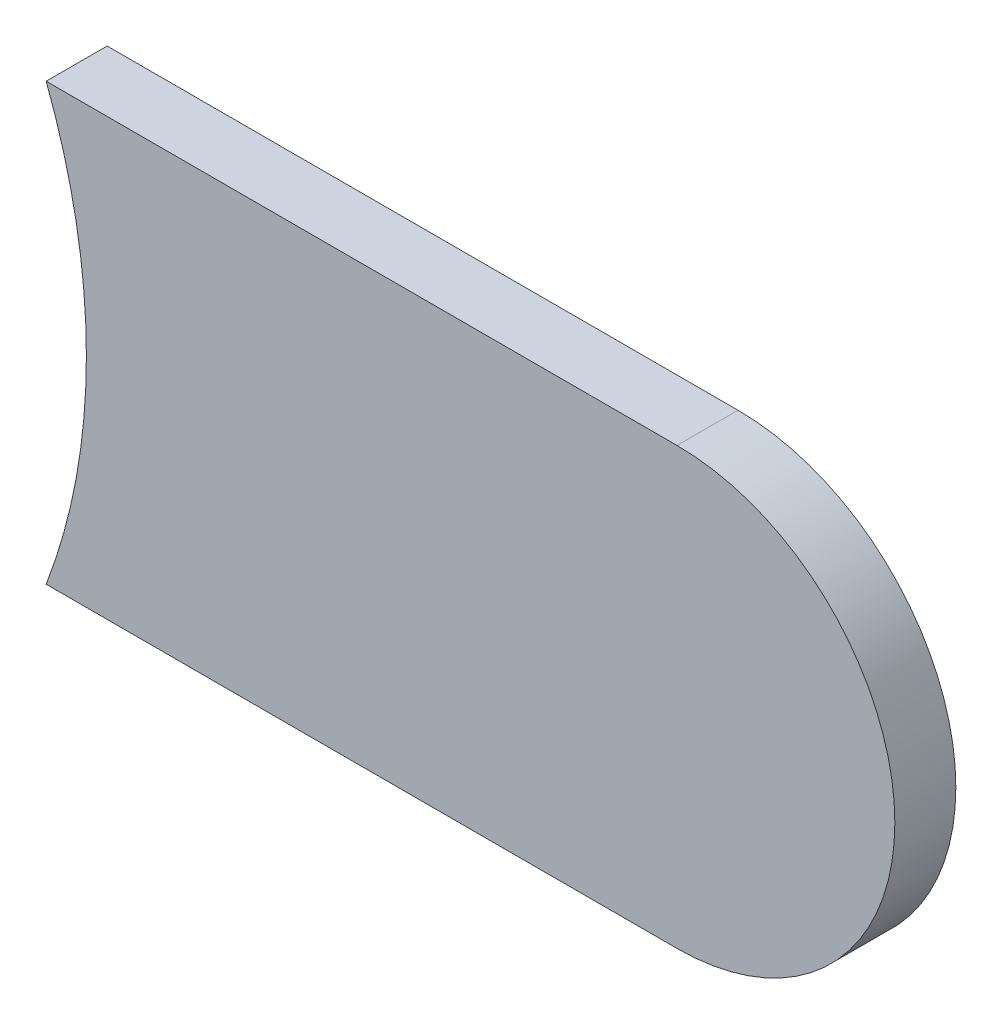
ISO-10303-21;
HEADER;
FILE_DESCRIPTION(('STEP AP214'),'2;1');
FILE_NAME('part.step','',(''),(''),'','','');
FILE_SCHEMA(('AUTOMOTIVE_DESIGN { 1 0 10303 214 1 1 1 1 }'));
ENDSEC;
DATA;
#1=APPLICATION_CONTEXT('core data for automotive mechanical design processes');
#2=APPLICATION_PROTOCOL_DEFINITION('international standard','automotive_design',2000,#1);
#3=PRODUCT_CONTEXT('',#1,'mechanical');
#4=PRODUCT('Part','Part','',(#3));
#5=PRODUCT_RELATED_PRODUCT_CATEGORY('part','',(#4));
#6=PRODUCT_DEFINITION_FORMATION('','',#4);
#7=PRODUCT_DEFINITION_CONTEXT('part definition',#1,'design');
#8=PRODUCT_DEFINITION('design','',#6,#7);
#9=PRODUCT_DEFINITION_SHAPE('','',#8);
#10=(LENGTH_UNIT() NAMED_UNIT(*) SI_UNIT(.MILLI.,.METRE.));
#11=(NAMED_UNIT(*) PLANE_ANGLE_UNIT() SI_UNIT($,.RADIAN.));
#12=(NAMED_UNIT(*) SI_UNIT($,.STERADIAN.) SOLID_ANGLE_UNIT());
#13=UNCERTAINTY_MEASURE_WITH_UNIT(LENGTH_MEASURE(1.E-05),#10,'distance_accuracy_value','');
#14=(GEOMETRIC_REPRESENTATION_CONTEXT(3) GLOBAL_UNCERTAINTY_ASSIGNED_CONTEXT((#13)) GLOBAL_UNIT_ASSIGNED_CONTEXT((#10,
#11,#12)) REPRESENTATION_CONTEXT('',''));
#15=CARTESIAN_POINT('',(0.,0.,0.));
#16=DIRECTION('',(0.,0.,1.));
#17=DIRECTION('',(1.,0.,0.));
#18=AXIS2_PLACEMENT_3D('',#15,#16,#17);
#19=CARTESIAN_POINT('',(93.0491203994978,92.55997236,0.));
#20=DIRECTION('',(0.,1.,0.));
#21=DIRECTION('',(1.,0.,0.));
#22=AXIS2_PLACEMENT_3D('',#19,#20,#21);
#23=PLANE('',#22);
#24=DIRECTION('',(1.,0.,0.));
#25=VECTOR('',#24,1.);
#26=CARTESIAN_POINT('',(92.7169723,92.55997236,0.03556));
#27=LINE('',#26,#25);
#28=CARTESIAN_POINT('',(93.0491203994978,92.55997236,0.03556));
#29=VERTEX_POINT('',#28);
#30=CARTESIAN_POINT('',(93.41697344,92.55997236,0.03556));
#31=VERTEX_POINT('',#30);
#32=EDGE_CURVE('E11',#29,#31,#27,.T.);
#33=ORIENTED_EDGE('',*,*,#32,.F.);
#34=DIRECTION('',(0.,0.,1.));
#35=VECTOR('',#34,1.);
#36=CARTESIAN_POINT('',(93.0491203994978,92.55997236,0.));
#37=LINE('',#36,#35);
#38=CARTESIAN_POINT('',(93.0491203994978,92.55997236,0.));
#39=VERTEX_POINT('',#38);
#40=EDGE_CURVE('E24',#39,#29,#37,.T.);
#41=ORIENTED_EDGE('',*,*,#40,.F.);
#42=DIRECTION('',(1.,0.,0.));
#43=VECTOR('',#42,1.);
#44=CARTESIAN_POINT('',(92.7169723,92.55997236,0.));
#45=LINE('',#44,#43);
#46=CARTESIAN_POINT('',(93.41697344,92.55997236,0.));
#47=VERTEX_POINT('',#46);
#48=EDGE_CURVE('E82',#39,#47,#45,.T.);
#49=ORIENTED_EDGE('',*,*,#48,.T.);
#50=DIRECTION('',(0.,0.,1.));
#51=VECTOR('',#50,1.);
#52=CARTESIAN_POINT('',(93.41697344,92.55997236,0.));
#53=LINE('',#52,#51);
#54=EDGE_CURVE('E37',#47,#31,#53,.T.);
#55=ORIENTED_EDGE('',*,*,#54,.T.);
#56=EDGE_LOOP('',(#33,#41,#49,#55));
#57=FACE_BOUND('',#56,.T.);
#58=ADVANCED_FACE('F17',(#57),#23,.F.);
#59=CARTESIAN_POINT('',(93.41697344,92.68697236,0.));
#60=DIRECTION('',(0.,0.,-1.));
#61=DIRECTION('',(-1.1189649382048E-13,-1.,0.));
#62=AXIS2_PLACEMENT_3D('',#59,#60,#61);
#63=CYLINDRICAL_SURFACE('',#62,0.127);
#64=CARTESIAN_POINT('',(93.41697344,92.68697236,0.03556));
#65=DIRECTION('',(0.,0.,1.));
#66=DIRECTION('',(-1.1189649382048E-13,-1.,0.));
#67=AXIS2_PLACEMENT_3D('',#64,#65,#66);
#68=CIRCLE('',#67,0.127);
#69=CARTESIAN_POINT('',(93.41697344,92.81397236,0.03556));
#70=VERTEX_POINT('',#69);
#71=EDGE_CURVE('E97',#31,#70,#68,.T.);
#72=ORIENTED_EDGE('',*,*,#71,.F.);
#73=ORIENTED_EDGE('',*,*,#54,.F.);
#74=CARTESIAN_POINT('',(93.41697344,92.68697236,0.));
#75=DIRECTION('',(0.,0.,1.));
#76=DIRECTION('',(-1.1189649382048E-13,-1.,0.));
#77=AXIS2_PLACEMENT_3D('',#74,#75,#76);
#78=CIRCLE('',#77,0.127);
#79=CARTESIAN_POINT('',(93.41697344,92.81397236,0.));
#80=VERTEX_POINT('',#79);
#81=EDGE_CURVE('E94',#47,#80,#78,.T.);
#82=ORIENTED_EDGE('',*,*,#81,.T.);
#83=DIRECTION('',(0.,0.,1.));
#84=VECTOR('',#83,1.);
#85=CARTESIAN_POINT('',(93.41697344,92.81397236,0.));
#86=LINE('',#85,#84);
#87=EDGE_CURVE('E92',#80,#70,#86,.T.);
#88=ORIENTED_EDGE('',*,*,#87,.T.);
#89=EDGE_LOOP('',(#72,#73,#82,#88));
#90=FACE_BOUND('',#89,.T.);
#91=ADVANCED_FACE('F103',(#90),#63,.T.);
#92=CARTESIAN_POINT('',(93.41697344,92.81397236,0.));
#93=DIRECTION('',(0.,-1.,0.));
#94=DIRECTION('',(-1.,0.,0.));
#95=AXIS2_PLACEMENT_3D('',#92,#93,#94);
#96=PLANE('',#95);
#97=DIRECTION('',(-1.,0.,0.));
#98=VECTOR('',#97,1.);
#99=CARTESIAN_POINT('',(93.41697344,92.81397236,0.03556));
#100=LINE('',#99,#98);
#101=CARTESIAN_POINT('',(93.0491203994978,92.81397236,0.03556));
#102=VERTEX_POINT('',#101);
#103=EDGE_CURVE('E89',#70,#102,#100,.T.);
#104=ORIENTED_EDGE('',*,*,#103,.F.);
#105=ORIENTED_EDGE('',*,*,#87,.F.);
#106=DIRECTION('',(-1.,0.,0.));
#107=VECTOR('',#106,1.);
#108=CARTESIAN_POINT('',(93.41697344,92.81397236,0.));
#109=LINE('',#108,#107);
#110=CARTESIAN_POINT('',(93.0491203994978,92.81397236,0.));
#111=VERTEX_POINT('',#110);
#112=EDGE_CURVE('E87',#80,#111,#109,.T.);
#113=ORIENTED_EDGE('',*,*,#112,.T.);
#114=DIRECTION('',(0.,0.,1.));
#115=VECTOR('',#114,1.);
#116=CARTESIAN_POINT('',(93.0491203994978,92.81397236,0.));
#117=LINE('',#116,#115);
#118=EDGE_CURVE('E69',#111,#102,#117,.T.);
#119=ORIENTED_EDGE('',*,*,#118,.T.);
#120=EDGE_LOOP('',(#104,#105,#113,#119));
#121=FACE_BOUND('',#120,.T.);
#122=ADVANCED_FACE('F108',(#121),#96,.F.);
#123=CARTESIAN_POINT('',(92.7169723,92.68697236,0.));
#124=DIRECTION('',(0.,0.,-1.));
#125=DIRECTION('',(1.,0.,0.));
#126=AXIS2_PLACEMENT_3D('',#123,#124,#125);
#127=CYLINDRICAL_SURFACE('',#126,0.3556);
#128=DIRECTION('',(0.,0.,1.));
#129=VECTOR('',#128,1.);
#130=CARTESIAN_POINT('',(93.0725723,92.68697236,0.));
#131=LINE('',#130,#129);
#132=CARTESIAN_POINT('',(93.0725723,92.68697236,0.));
#133=VERTEX_POINT('',#132);
#134=CARTESIAN_POINT('',(93.0725723,92.68697236,0.03556));
#135=VERTEX_POINT('',#134);
#136=EDGE_CURVE('E59',#133,#135,#131,.T.);
#137=ORIENTED_EDGE('',*,*,#136,.T.);
#138=CARTESIAN_POINT('',(92.7169723,92.68697236,0.03556));
#139=DIRECTION('',(0.,0.,1.));
#140=DIRECTION('',(1.,0.,0.));
#141=AXIS2_PLACEMENT_3D('',#138,#139,#140);
#142=CIRCLE('',#141,0.3556);
#143=EDGE_CURVE('E70',#135,#102,#142,.T.);
#144=ORIENTED_EDGE('',*,*,#143,.T.);
#145=ORIENTED_EDGE('',*,*,#118,.F.);
#146=CARTESIAN_POINT('',(92.7169723,92.68697236,0.));
#147=DIRECTION('',(0.,0.,1.));
#148=DIRECTION('',(1.,0.,0.));
#149=AXIS2_PLACEMENT_3D('',#146,#147,#148);
#150=CIRCLE('',#149,0.3556);
#151=EDGE_CURVE('E73',#133,#111,#150,.T.);
#152=ORIENTED_EDGE('',*,*,#151,.F.);
#153=EDGE_LOOP('',(#137,#144,#145,#152));
#154=FACE_BOUND('',#153,.T.);
#155=ADVANCED_FACE('F74',(#154),#127,.F.);
#156=CARTESIAN_POINT('',(92.7169723,92.68697236,0.));
#157=DIRECTION('',(0.,0.,-1.));
#158=DIRECTION('',(1.,0.,0.));
#159=AXIS2_PLACEMENT_3D('',#156,#157,#158);
#160=CYLINDRICAL_SURFACE('',#159,0.3556);
#161=ORIENTED_EDGE('',*,*,#40,.T.);
#162=CARTESIAN_POINT('',(92.7169723,92.68697236,0.03556));
#163=DIRECTION('',(0.,0.,1.));
#164=DIRECTION('',(1.,0.,0.));
#165=AXIS2_PLACEMENT_3D('',#162,#163,#164);
#166=CIRCLE('',#165,0.3556);
#167=EDGE_CURVE('E65',#29,#135,#166,.T.);
#168=ORIENTED_EDGE('',*,*,#167,.T.);
#169=ORIENTED_EDGE('',*,*,#136,.F.);
#170=EDGE_CURVE('E63',#39,#133,#150,.T.);
#171=ORIENTED_EDGE('',*,*,#170,.F.);
#172=EDGE_LOOP('',(#161,#168,#169,#171));
#173=FACE_BOUND('',#172,.T.);
#174=ADVANCED_FACE('F61',(#173),#160,.F.);
#175=CARTESIAN_POINT('',(92.7169723,92.55997236,0.));
#176=DIRECTION('',(0.,0.,-1.));
#177=DIRECTION('',(-1.,0.,0.));
#178=AXIS2_PLACEMENT_3D('',#175,#176,#177);
#179=PLANE('',#178);
#180=ORIENTED_EDGE('',*,*,#48,.F.);
#181=ORIENTED_EDGE('',*,*,#170,.T.);
#182=ORIENTED_EDGE('',*,*,#151,.T.);
#183=ORIENTED_EDGE('',*,*,#112,.F.);
#184=ORIENTED_EDGE('',*,*,#81,.F.);
#185=EDGE_LOOP('',(#180,#181,#182,#183,#184));
#186=FACE_BOUND('',#185,.T.);
#187=ADVANCED_FACE('F80',(#186),#179,.T.);
#188=CARTESIAN_POINT('',(92.7169723,92.55997236,0.03556));
#189=DIRECTION('',(0.,0.,-1.));
#190=DIRECTION('',(-1.,0.,0.));
#191=AXIS2_PLACEMENT_3D('',#188,#189,#190);
#192=PLANE('',#191);
#193=ORIENTED_EDGE('',*,*,#167,.F.);
#194=ORIENTED_EDGE('',*,*,#32,.T.);
#195=ORIENTED_EDGE('',*,*,#71,.T.);
#196=ORIENTED_EDGE('',*,*,#103,.T.);
#197=ORIENTED_EDGE('',*,*,#143,.F.);
#198=EDGE_LOOP('',(#193,#194,#195,#196,#197));
#199=FACE_BOUND('',#198,.T.);
#200=ADVANCED_FACE('F106',(#199),#192,.F.);
#201=CLOSED_SHELL('',(#58,#91,#122,#155,#174,#187,#200));
#202=MANIFOLD_SOLID_BREP('B1',#201);
#203=ADVANCED_BREP_SHAPE_REPRESENTATION('',(#18,#202),#14);
#204=SHAPE_DEFINITION_REPRESENTATION(#9,#203);
ENDSEC;
END-ISO-10303-21;
